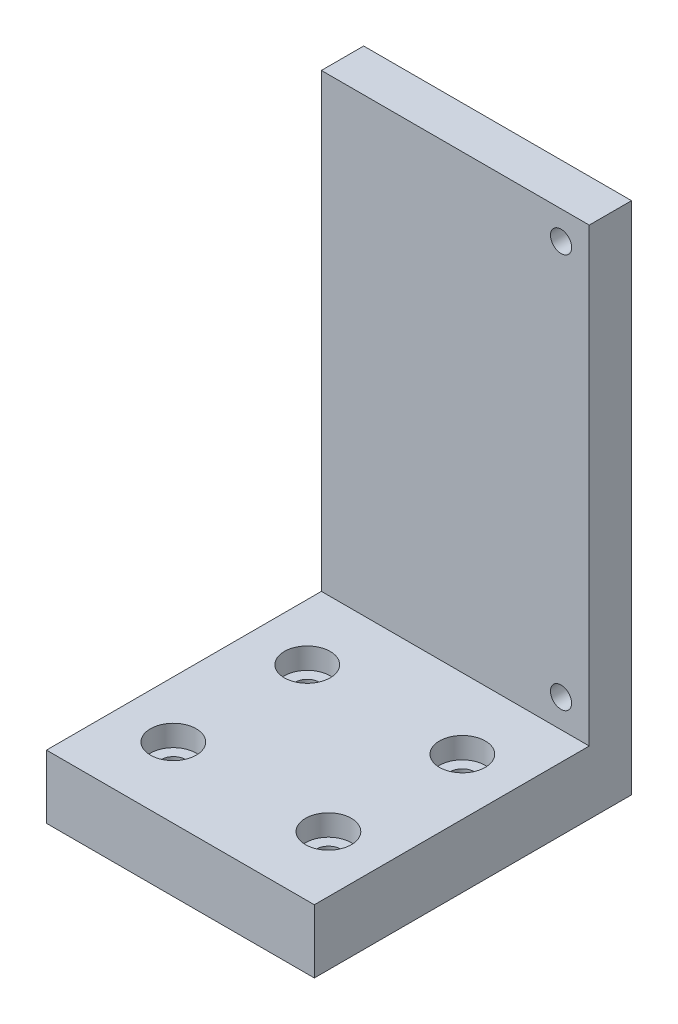
ISO-10303-21;
HEADER;
FILE_DESCRIPTION(('STEP AP214'),'2;1');
FILE_NAME('part.step','',(''),(''),'','','');
FILE_SCHEMA(('AUTOMOTIVE_DESIGN { 1 0 10303 214 1 1 1 1 }'));
ENDSEC;
DATA;
#1=APPLICATION_CONTEXT('core data for automotive mechanical design processes');
#2=APPLICATION_PROTOCOL_DEFINITION('international standard','automotive_design',2000,#1);
#3=PRODUCT_CONTEXT('',#1,'mechanical');
#4=PRODUCT('Part','Part','',(#3));
#5=PRODUCT_RELATED_PRODUCT_CATEGORY('part','',(#4));
#6=PRODUCT_DEFINITION_FORMATION('','',#4);
#7=PRODUCT_DEFINITION_CONTEXT('part definition',#1,'design');
#8=PRODUCT_DEFINITION('design','',#6,#7);
#9=PRODUCT_DEFINITION_SHAPE('','',#8);
#10=(LENGTH_UNIT() NAMED_UNIT(*) SI_UNIT(.MILLI.,.METRE.));
#11=(NAMED_UNIT(*) PLANE_ANGLE_UNIT() SI_UNIT($,.RADIAN.));
#12=(NAMED_UNIT(*) SI_UNIT($,.STERADIAN.) SOLID_ANGLE_UNIT());
#13=UNCERTAINTY_MEASURE_WITH_UNIT(LENGTH_MEASURE(1.E-05),#10,'distance_accuracy_value','');
#14=(GEOMETRIC_REPRESENTATION_CONTEXT(3) GLOBAL_UNCERTAINTY_ASSIGNED_CONTEXT((#13)) GLOBAL_UNIT_ASSIGNED_CONTEXT((#10,
#11,#12)) REPRESENTATION_CONTEXT('',''));
#15=CARTESIAN_POINT('',(0.,0.,0.));
#16=DIRECTION('',(0.,0.,1.));
#17=DIRECTION('',(1.,0.,0.));
#18=AXIS2_PLACEMENT_3D('',#15,#16,#17);
#19=CARTESIAN_POINT('',(0.,9.,0.));
#20=DIRECTION('',(0.,-1.,0.));
#21=DIRECTION('',(0.,0.,-1.));
#22=AXIS2_PLACEMENT_3D('',#19,#20,#21);
#23=PLANE('',#22);
#24=CARTESIAN_POINT('',(8.,9.,-29.));
#25=DIRECTION('',(0.,1.,0.));
#26=DIRECTION('',(0.,0.,1.));
#27=AXIS2_PLACEMENT_3D('',#24,#25,#26);
#28=CIRCLE('',#27,3.25);
#29=CARTESIAN_POINT('',(8.,9.,-25.75));
#30=VERTEX_POINT('',#29);
#31=EDGE_CURVE('E183',#30,#30,#28,.T.);
#32=ORIENTED_EDGE('',*,*,#31,.F.);
#33=EDGE_LOOP('',(#32));
#34=FACE_BOUND('',#33,.T.);
#35=CARTESIAN_POINT('',(8.,9.,-10.));
#36=DIRECTION('',(0.,1.,0.));
#37=DIRECTION('',(0.,0.,1.));
#38=AXIS2_PLACEMENT_3D('',#35,#36,#37);
#39=CIRCLE('',#38,3.25);
#40=CARTESIAN_POINT('',(8.,9.,-6.75));
#41=VERTEX_POINT('',#40);
#42=EDGE_CURVE('E171',#41,#41,#39,.T.);
#43=ORIENTED_EDGE('',*,*,#42,.F.);
#44=EDGE_LOOP('',(#43));
#45=FACE_BOUND('',#44,.T.);
#46=CARTESIAN_POINT('',(30.,9.,-10.));
#47=DIRECTION('',(0.,1.,0.));
#48=DIRECTION('',(0.,0.,1.));
#49=AXIS2_PLACEMENT_3D('',#46,#47,#48);
#50=CIRCLE('',#49,3.25);
#51=CARTESIAN_POINT('',(30.,9.,-6.75));
#52=VERTEX_POINT('',#51);
#53=EDGE_CURVE('E159',#52,#52,#50,.T.);
#54=ORIENTED_EDGE('',*,*,#53,.F.);
#55=EDGE_LOOP('',(#54));
#56=FACE_BOUND('',#55,.T.);
#57=CARTESIAN_POINT('',(30.,9.,-29.));
#58=DIRECTION('',(0.,1.,0.));
#59=DIRECTION('',(0.,0.,1.));
#60=AXIS2_PLACEMENT_3D('',#57,#58,#59);
#61=CIRCLE('',#60,3.25);
#62=CARTESIAN_POINT('',(30.,9.,-25.75));
#63=VERTEX_POINT('',#62);
#64=EDGE_CURVE('E147',#63,#63,#61,.T.);
#65=ORIENTED_EDGE('',*,*,#64,.F.);
#66=EDGE_LOOP('',(#65));
#67=FACE_BOUND('',#66,.T.);
#68=DIRECTION('',(1.,0.,0.));
#69=VECTOR('',#68,1.);
#70=CARTESIAN_POINT('',(0.,9.,-39.));
#71=LINE('',#70,#69);
#72=CARTESIAN_POINT('',(0.,9.,-39.));
#73=VERTEX_POINT('',#72);
#74=CARTESIAN_POINT('',(38.,9.,-39.));
#75=VERTEX_POINT('',#74);
#76=EDGE_CURVE('E49',#73,#75,#71,.T.);
#77=ORIENTED_EDGE('',*,*,#76,.F.);
#78=DIRECTION('',(0.,0.,-1.));
#79=VECTOR('',#78,1.);
#80=CARTESIAN_POINT('',(0.,9.,0.));
#81=LINE('',#80,#79);
#82=CARTESIAN_POINT('',(0.,9.,0.));
#83=VERTEX_POINT('',#82);
#84=EDGE_CURVE('E86',#83,#73,#81,.T.);
#85=ORIENTED_EDGE('',*,*,#84,.F.);
#86=DIRECTION('',(1.,0.,0.));
#87=VECTOR('',#86,1.);
#88=CARTESIAN_POINT('',(0.,9.,0.));
#89=LINE('',#88,#87);
#90=CARTESIAN_POINT('',(38.,9.,0.));
#91=VERTEX_POINT('',#90);
#92=EDGE_CURVE('E77',#83,#91,#89,.T.);
#93=ORIENTED_EDGE('',*,*,#92,.T.);
#94=DIRECTION('',(0.,0.,-1.));
#95=VECTOR('',#94,1.);
#96=CARTESIAN_POINT('',(38.,9.,0.));
#97=LINE('',#96,#95);
#98=EDGE_CURVE('E106',#91,#75,#97,.T.);
#99=ORIENTED_EDGE('',*,*,#98,.T.);
#100=EDGE_LOOP('',(#77,#85,#93,#99));
#101=FACE_BOUND('',#100,.T.);
#102=ADVANCED_FACE('F32',(#34,#45,#56,#67,#101),#23,.F.);
#103=CARTESIAN_POINT('',(0.,9.,0.));
#104=DIRECTION('',(-1.,0.,0.));
#105=DIRECTION('',(0.,0.,1.));
#106=AXIS2_PLACEMENT_3D('',#103,#104,#105);
#107=PLANE('',#106);
#108=DIRECTION('',(0.,0.,-1.));
#109=VECTOR('',#108,1.);
#110=CARTESIAN_POINT('',(0.,0.,0.));
#111=LINE('',#110,#109);
#112=CARTESIAN_POINT('',(0.,0.,0.));
#113=VERTEX_POINT('',#112);
#114=CARTESIAN_POINT('',(0.,0.,-45.));
#115=VERTEX_POINT('',#114);
#116=EDGE_CURVE('E83',#113,#115,#111,.T.);
#117=ORIENTED_EDGE('',*,*,#116,.F.);
#118=DIRECTION('',(0.,-1.,0.));
#119=VECTOR('',#118,1.);
#120=CARTESIAN_POINT('',(0.,9.,0.));
#121=LINE('',#120,#119);
#122=EDGE_CURVE('E11',#83,#113,#121,.T.);
#123=ORIENTED_EDGE('',*,*,#122,.F.);
#124=ORIENTED_EDGE('',*,*,#84,.T.);
#125=DIRECTION('',(0.,-1.,0.));
#126=VECTOR('',#125,1.);
#127=CARTESIAN_POINT('',(0.,73.,-39.));
#128=LINE('',#127,#126);
#129=CARTESIAN_POINT('',(0.,73.,-39.));
#130=VERTEX_POINT('',#129);
#131=EDGE_CURVE('E92',#130,#73,#128,.T.);
#132=ORIENTED_EDGE('',*,*,#131,.F.);
#133=DIRECTION('',(0.,0.,1.));
#134=VECTOR('',#133,1.);
#135=CARTESIAN_POINT('',(0.,73.,-45.));
#136=LINE('',#135,#134);
#137=CARTESIAN_POINT('',(0.,73.,-45.));
#138=VERTEX_POINT('',#137);
#139=EDGE_CURVE('E115',#138,#130,#136,.T.);
#140=ORIENTED_EDGE('',*,*,#139,.F.);
#141=DIRECTION('',(0.,-1.,0.));
#142=VECTOR('',#141,1.);
#143=CARTESIAN_POINT('',(0.,9.,-45.));
#144=LINE('',#143,#142);
#145=EDGE_CURVE('E36',#138,#115,#144,.T.);
#146=ORIENTED_EDGE('',*,*,#145,.T.);
#147=EDGE_LOOP('',(#117,#123,#124,#132,#140,#146));
#148=FACE_BOUND('',#147,.T.);
#149=ADVANCED_FACE('F34',(#148),#107,.T.);
#150=CARTESIAN_POINT('',(0.,9.,0.));
#151=DIRECTION('',(0.,0.,-1.));
#152=DIRECTION('',(-1.,0.,0.));
#153=AXIS2_PLACEMENT_3D('',#150,#151,#152);
#154=PLANE('',#153);
#155=DIRECTION('',(1.,0.,0.));
#156=VECTOR('',#155,1.);
#157=CARTESIAN_POINT('',(0.,0.,0.));
#158=LINE('',#157,#156);
#159=CARTESIAN_POINT('',(38.,0.,0.));
#160=VERTEX_POINT('',#159);
#161=EDGE_CURVE('E75',#113,#160,#158,.T.);
#162=ORIENTED_EDGE('',*,*,#161,.T.);
#163=DIRECTION('',(0.,-1.,0.));
#164=VECTOR('',#163,1.);
#165=CARTESIAN_POINT('',(38.,9.,0.));
#166=LINE('',#165,#164);
#167=EDGE_CURVE('E41',#91,#160,#166,.T.);
#168=ORIENTED_EDGE('',*,*,#167,.F.);
#169=ORIENTED_EDGE('',*,*,#92,.F.);
#170=ORIENTED_EDGE('',*,*,#122,.T.);
#171=EDGE_LOOP('',(#162,#168,#169,#170));
#172=FACE_BOUND('',#171,.T.);
#173=ADVANCED_FACE('F73',(#172),#154,.F.);
#174=CARTESIAN_POINT('',(38.,9.,0.));
#175=DIRECTION('',(-1.,0.,0.));
#176=DIRECTION('',(0.,0.,1.));
#177=AXIS2_PLACEMENT_3D('',#174,#175,#176);
#178=PLANE('',#177);
#179=DIRECTION('',(0.,0.,-1.));
#180=VECTOR('',#179,1.);
#181=CARTESIAN_POINT('',(38.,0.,0.));
#182=LINE('',#181,#180);
#183=CARTESIAN_POINT('',(38.,0.,-45.));
#184=VERTEX_POINT('',#183);
#185=EDGE_CURVE('E85',#160,#184,#182,.T.);
#186=ORIENTED_EDGE('',*,*,#185,.T.);
#187=DIRECTION('',(0.,-1.,0.));
#188=VECTOR('',#187,1.);
#189=CARTESIAN_POINT('',(38.,9.,-45.));
#190=LINE('',#189,#188);
#191=CARTESIAN_POINT('',(38.,73.,-45.));
#192=VERTEX_POINT('',#191);
#193=EDGE_CURVE('E102',#192,#184,#190,.T.);
#194=ORIENTED_EDGE('',*,*,#193,.F.);
#195=DIRECTION('',(0.,0.,-1.));
#196=VECTOR('',#195,1.);
#197=CARTESIAN_POINT('',(38.,73.,-45.));
#198=LINE('',#197,#196);
#199=CARTESIAN_POINT('',(38.,73.,-39.));
#200=VERTEX_POINT('',#199);
#201=EDGE_CURVE('E119',#200,#192,#198,.T.);
#202=ORIENTED_EDGE('',*,*,#201,.F.);
#203=DIRECTION('',(0.,-1.,0.));
#204=VECTOR('',#203,1.);
#205=CARTESIAN_POINT('',(38.,73.,-39.));
#206=LINE('',#205,#204);
#207=EDGE_CURVE('E96',#200,#75,#206,.T.);
#208=ORIENTED_EDGE('',*,*,#207,.T.);
#209=ORIENTED_EDGE('',*,*,#98,.F.);
#210=ORIENTED_EDGE('',*,*,#167,.T.);
#211=EDGE_LOOP('',(#186,#194,#202,#208,#209,#210));
#212=FACE_BOUND('',#211,.T.);
#213=ADVANCED_FACE('F242',(#212),#178,.F.);
#214=CARTESIAN_POINT('',(0.,9.,-45.));
#215=DIRECTION('',(0.,0.,-1.));
#216=DIRECTION('',(-1.,0.,0.));
#217=AXIS2_PLACEMENT_3D('',#214,#215,#216);
#218=PLANE('',#217);
#219=CARTESIAN_POINT('',(34.,69.,-45.));
#220=DIRECTION('',(0.,0.,-1.));
#221=DIRECTION('',(-1.,0.,0.));
#222=AXIS2_PLACEMENT_3D('',#219,#220,#221);
#223=CIRCLE('',#222,1.5);
#224=CARTESIAN_POINT('',(32.5,69.,-45.));
#225=VERTEX_POINT('',#224);
#226=EDGE_CURVE('E116',#225,#225,#223,.T.);
#227=ORIENTED_EDGE('',*,*,#226,.F.);
#228=EDGE_LOOP('',(#227));
#229=FACE_BOUND('',#228,.T.);
#230=CARTESIAN_POINT('',(34.,13.,-45.));
#231=DIRECTION('',(0.,0.,-1.));
#232=DIRECTION('',(-1.,0.,0.));
#233=AXIS2_PLACEMENT_3D('',#230,#231,#232);
#234=CIRCLE('',#233,1.5);
#235=CARTESIAN_POINT('',(32.5,13.,-45.));
#236=VERTEX_POINT('',#235);
#237=EDGE_CURVE('E129',#236,#236,#234,.T.);
#238=ORIENTED_EDGE('',*,*,#237,.F.);
#239=EDGE_LOOP('',(#238));
#240=FACE_BOUND('',#239,.T.);
#241=DIRECTION('',(1.,0.,0.));
#242=VECTOR('',#241,1.);
#243=CARTESIAN_POINT('',(0.,0.,-45.));
#244=LINE('',#243,#242);
#245=EDGE_CURVE('E91',#115,#184,#244,.T.);
#246=ORIENTED_EDGE('',*,*,#245,.F.);
#247=ORIENTED_EDGE('',*,*,#145,.F.);
#248=DIRECTION('',(-1.,0.,0.));
#249=VECTOR('',#248,1.);
#250=CARTESIAN_POINT('',(0.,73.,-45.));
#251=LINE('',#250,#249);
#252=EDGE_CURVE('E113',#192,#138,#251,.T.);
#253=ORIENTED_EDGE('',*,*,#252,.F.);
#254=ORIENTED_EDGE('',*,*,#193,.T.);
#255=EDGE_LOOP('',(#246,#247,#253,#254));
#256=FACE_BOUND('',#255,.T.);
#257=ADVANCED_FACE('F238',(#229,#240,#256),#218,.T.);
#258=CARTESIAN_POINT('',(0.,0.,0.));
#259=DIRECTION('',(0.,-1.,0.));
#260=DIRECTION('',(0.,0.,-1.));
#261=AXIS2_PLACEMENT_3D('',#258,#259,#260);
#262=PLANE('',#261);
#263=CARTESIAN_POINT('',(8.,0.,-29.));
#264=DIRECTION('',(0.,1.,0.));
#265=DIRECTION('',(0.,0.,1.));
#266=AXIS2_PLACEMENT_3D('',#263,#264,#265);
#267=CIRCLE('',#266,1.7);
#268=CARTESIAN_POINT('',(8.,0.,-27.3));
#269=VERTEX_POINT('',#268);
#270=EDGE_CURVE('E174',#269,#269,#267,.T.);
#271=ORIENTED_EDGE('',*,*,#270,.T.);
#272=EDGE_LOOP('',(#271));
#273=FACE_BOUND('',#272,.T.);
#274=CARTESIAN_POINT('',(8.,0.,-10.));
#275=DIRECTION('',(0.,1.,0.));
#276=DIRECTION('',(0.,0.,1.));
#277=AXIS2_PLACEMENT_3D('',#274,#275,#276);
#278=CIRCLE('',#277,1.7);
#279=CARTESIAN_POINT('',(8.,0.,-8.3));
#280=VERTEX_POINT('',#279);
#281=EDGE_CURVE('E162',#280,#280,#278,.T.);
#282=ORIENTED_EDGE('',*,*,#281,.T.);
#283=EDGE_LOOP('',(#282));
#284=FACE_BOUND('',#283,.T.);
#285=CARTESIAN_POINT('',(30.,0.,-10.));
#286=DIRECTION('',(0.,1.,0.));
#287=DIRECTION('',(0.,0.,1.));
#288=AXIS2_PLACEMENT_3D('',#285,#286,#287);
#289=CIRCLE('',#288,1.7);
#290=CARTESIAN_POINT('',(30.,0.,-8.3));
#291=VERTEX_POINT('',#290);
#292=EDGE_CURVE('E150',#291,#291,#289,.T.);
#293=ORIENTED_EDGE('',*,*,#292,.T.);
#294=EDGE_LOOP('',(#293));
#295=FACE_BOUND('',#294,.T.);
#296=CARTESIAN_POINT('',(30.,0.,-29.));
#297=DIRECTION('',(0.,1.,0.));
#298=DIRECTION('',(0.,0.,1.));
#299=AXIS2_PLACEMENT_3D('',#296,#297,#298);
#300=CIRCLE('',#299,1.7);
#301=CARTESIAN_POINT('',(30.,0.,-27.3));
#302=VERTEX_POINT('',#301);
#303=EDGE_CURVE('E136',#302,#302,#300,.T.);
#304=ORIENTED_EDGE('',*,*,#303,.T.);
#305=EDGE_LOOP('',(#304));
#306=FACE_BOUND('',#305,.T.);
#307=ORIENTED_EDGE('',*,*,#116,.T.);
#308=ORIENTED_EDGE('',*,*,#245,.T.);
#309=ORIENTED_EDGE('',*,*,#185,.F.);
#310=ORIENTED_EDGE('',*,*,#161,.F.);
#311=EDGE_LOOP('',(#307,#308,#309,#310));
#312=FACE_BOUND('',#311,.T.);
#313=ADVANCED_FACE('F81',(#273,#284,#295,#306,#312),#262,.T.);
#314=CARTESIAN_POINT('',(0.,73.,-39.));
#315=DIRECTION('',(0.,0.,-1.));
#316=DIRECTION('',(-1.,0.,0.));
#317=AXIS2_PLACEMENT_3D('',#314,#315,#316);
#318=PLANE('',#317);
#319=CARTESIAN_POINT('',(34.,69.,-39.));
#320=DIRECTION('',(0.,0.,1.));
#321=DIRECTION('',(1.,0.,0.));
#322=AXIS2_PLACEMENT_3D('',#319,#320,#321);
#323=CIRCLE('',#322,1.5);
#324=CARTESIAN_POINT('',(35.5,69.,-39.));
#325=VERTEX_POINT('',#324);
#326=EDGE_CURVE('E132',#325,#325,#323,.T.);
#327=ORIENTED_EDGE('',*,*,#326,.F.);
#328=EDGE_LOOP('',(#327));
#329=FACE_BOUND('',#328,.T.);
#330=CARTESIAN_POINT('',(34.,13.,-39.));
#331=DIRECTION('',(0.,0.,1.));
#332=DIRECTION('',(1.,0.,0.));
#333=AXIS2_PLACEMENT_3D('',#330,#331,#332);
#334=CIRCLE('',#333,1.5);
#335=CARTESIAN_POINT('',(35.5,13.,-39.));
#336=VERTEX_POINT('',#335);
#337=EDGE_CURVE('E133',#336,#336,#334,.T.);
#338=ORIENTED_EDGE('',*,*,#337,.F.);
#339=EDGE_LOOP('',(#338));
#340=FACE_BOUND('',#339,.T.);
#341=ORIENTED_EDGE('',*,*,#76,.T.);
#342=ORIENTED_EDGE('',*,*,#207,.F.);
#343=DIRECTION('',(1.,0.,0.));
#344=VECTOR('',#343,1.);
#345=CARTESIAN_POINT('',(0.,73.,-39.));
#346=LINE('',#345,#344);
#347=EDGE_CURVE('E122',#130,#200,#346,.T.);
#348=ORIENTED_EDGE('',*,*,#347,.F.);
#349=ORIENTED_EDGE('',*,*,#131,.T.);
#350=EDGE_LOOP('',(#341,#342,#348,#349));
#351=FACE_BOUND('',#350,.T.);
#352=ADVANCED_FACE('F231',(#329,#340,#351),#318,.F.);
#353=CARTESIAN_POINT('',(0.,73.,0.));
#354=DIRECTION('',(0.,1.,0.));
#355=DIRECTION('',(0.,0.,1.));
#356=AXIS2_PLACEMENT_3D('',#353,#354,#355);
#357=PLANE('',#356);
#358=ORIENTED_EDGE('',*,*,#139,.T.);
#359=ORIENTED_EDGE('',*,*,#347,.T.);
#360=ORIENTED_EDGE('',*,*,#201,.T.);
#361=ORIENTED_EDGE('',*,*,#252,.T.);
#362=EDGE_LOOP('',(#358,#359,#360,#361));
#363=FACE_BOUND('',#362,.T.);
#364=ADVANCED_FACE('F227',(#363),#357,.T.);
#365=CARTESIAN_POINT('',(34.,13.,-103.));
#366=DIRECTION('',(0.,0.,1.));
#367=DIRECTION('',(1.,0.,0.));
#368=AXIS2_PLACEMENT_3D('',#365,#366,#367);
#369=CYLINDRICAL_SURFACE('',#368,1.5);
#370=ORIENTED_EDGE('',*,*,#237,.T.);
#371=EDGE_LOOP('',(#370));
#372=FACE_BOUND('',#371,.T.);
#373=ORIENTED_EDGE('',*,*,#337,.T.);
#374=EDGE_LOOP('',(#373));
#375=FACE_BOUND('',#374,.T.);
#376=ADVANCED_FACE('F223',(#372,#375),#369,.F.);
#377=CARTESIAN_POINT('',(34.,69.,-103.));
#378=DIRECTION('',(0.,0.,1.));
#379=DIRECTION('',(1.,0.,0.));
#380=AXIS2_PLACEMENT_3D('',#377,#378,#379);
#381=CYLINDRICAL_SURFACE('',#380,1.5);
#382=ORIENTED_EDGE('',*,*,#226,.T.);
#383=EDGE_LOOP('',(#382));
#384=FACE_BOUND('',#383,.T.);
#385=ORIENTED_EDGE('',*,*,#326,.T.);
#386=EDGE_LOOP('',(#385));
#387=FACE_BOUND('',#386,.T.);
#388=ADVANCED_FACE('F219',(#384,#387),#381,.F.);
#389=CARTESIAN_POINT('',(30.,9.,-29.));
#390=DIRECTION('',(0.,1.,0.));
#391=DIRECTION('',(0.,0.,1.));
#392=AXIS2_PLACEMENT_3D('',#389,#390,#391);
#393=CYLINDRICAL_SURFACE('',#392,1.7);
#394=ORIENTED_EDGE('',*,*,#303,.F.);
#395=EDGE_LOOP('',(#394));
#396=FACE_BOUND('',#395,.T.);
#397=CARTESIAN_POINT('',(30.,6.,-29.));
#398=DIRECTION('',(0.,1.,0.));
#399=DIRECTION('',(0.,0.,1.));
#400=AXIS2_PLACEMENT_3D('',#397,#398,#399);
#401=CIRCLE('',#400,1.7);
#402=CARTESIAN_POINT('',(30.,6.,-27.3));
#403=VERTEX_POINT('',#402);
#404=EDGE_CURVE('E141',#403,#403,#401,.T.);
#405=ORIENTED_EDGE('',*,*,#404,.T.);
#406=EDGE_LOOP('',(#405));
#407=FACE_BOUND('',#406,.T.);
#408=ADVANCED_FACE('F211',(#396,#407),#393,.F.);
#409=CARTESIAN_POINT('',(31.7,6.,-29.));
#410=DIRECTION('',(0.,-1.,0.));
#411=DIRECTION('',(0.,0.,-1.));
#412=AXIS2_PLACEMENT_3D('',#409,#410,#411);
#413=PLANE('',#412);
#414=ORIENTED_EDGE('',*,*,#404,.F.);
#415=EDGE_LOOP('',(#414));
#416=FACE_BOUND('',#415,.T.);
#417=CARTESIAN_POINT('',(30.,6.,-29.));
#418=DIRECTION('',(0.,1.,0.));
#419=DIRECTION('',(0.,0.,1.));
#420=AXIS2_PLACEMENT_3D('',#417,#418,#419);
#421=CIRCLE('',#420,3.25);
#422=CARTESIAN_POINT('',(30.,6.,-25.75));
#423=VERTEX_POINT('',#422);
#424=EDGE_CURVE('E144',#423,#423,#421,.T.);
#425=ORIENTED_EDGE('',*,*,#424,.T.);
#426=EDGE_LOOP('',(#425));
#427=FACE_BOUND('',#426,.T.);
#428=ADVANCED_FACE('F201',(#416,#427),#413,.F.);
#429=CARTESIAN_POINT('',(30.,9.,-29.));
#430=DIRECTION('',(0.,1.,0.));
#431=DIRECTION('',(0.,0.,1.));
#432=AXIS2_PLACEMENT_3D('',#429,#430,#431);
#433=CYLINDRICAL_SURFACE('',#432,3.25);
#434=ORIENTED_EDGE('',*,*,#424,.F.);
#435=EDGE_LOOP('',(#434));
#436=FACE_BOUND('',#435,.T.);
#437=ORIENTED_EDGE('',*,*,#64,.T.);
#438=EDGE_LOOP('',(#437));
#439=FACE_BOUND('',#438,.T.);
#440=ADVANCED_FACE('F198',(#436,#439),#433,.F.);
#441=CARTESIAN_POINT('',(30.,9.,-10.));
#442=DIRECTION('',(0.,1.,0.));
#443=DIRECTION('',(0.,0.,1.));
#444=AXIS2_PLACEMENT_3D('',#441,#442,#443);
#445=CYLINDRICAL_SURFACE('',#444,1.7);
#446=ORIENTED_EDGE('',*,*,#292,.F.);
#447=EDGE_LOOP('',(#446));
#448=FACE_BOUND('',#447,.T.);
#449=CARTESIAN_POINT('',(30.,6.,-10.));
#450=DIRECTION('',(0.,1.,0.));
#451=DIRECTION('',(0.,0.,1.));
#452=AXIS2_PLACEMENT_3D('',#449,#450,#451);
#453=CIRCLE('',#452,1.7);
#454=CARTESIAN_POINT('',(30.,6.,-8.3));
#455=VERTEX_POINT('',#454);
#456=EDGE_CURVE('E153',#455,#455,#453,.T.);
#457=ORIENTED_EDGE('',*,*,#456,.T.);
#458=EDGE_LOOP('',(#457));
#459=FACE_BOUND('',#458,.T.);
#460=ADVANCED_FACE('F200',(#448,#459),#445,.F.);
#461=CARTESIAN_POINT('',(31.7,6.,-10.));
#462=DIRECTION('',(0.,-1.,0.));
#463=DIRECTION('',(0.,0.,-1.));
#464=AXIS2_PLACEMENT_3D('',#461,#462,#463);
#465=PLANE('',#464);
#466=ORIENTED_EDGE('',*,*,#456,.F.);
#467=EDGE_LOOP('',(#466));
#468=FACE_BOUND('',#467,.T.);
#469=CARTESIAN_POINT('',(30.,6.,-10.));
#470=DIRECTION('',(0.,1.,0.));
#471=DIRECTION('',(0.,0.,1.));
#472=AXIS2_PLACEMENT_3D('',#469,#470,#471);
#473=CIRCLE('',#472,3.25);
#474=CARTESIAN_POINT('',(30.,6.,-6.75));
#475=VERTEX_POINT('',#474);
#476=EDGE_CURVE('E156',#475,#475,#473,.T.);
#477=ORIENTED_EDGE('',*,*,#476,.T.);
#478=EDGE_LOOP('',(#477));
#479=FACE_BOUND('',#478,.T.);
#480=ADVANCED_FACE('F208',(#468,#479),#465,.F.);
#481=CARTESIAN_POINT('',(30.,9.,-10.));
#482=DIRECTION('',(0.,1.,0.));
#483=DIRECTION('',(0.,0.,1.));
#484=AXIS2_PLACEMENT_3D('',#481,#482,#483);
#485=CYLINDRICAL_SURFACE('',#484,3.25);
#486=ORIENTED_EDGE('',*,*,#476,.F.);
#487=EDGE_LOOP('',(#486));
#488=FACE_BOUND('',#487,.T.);
#489=ORIENTED_EDGE('',*,*,#53,.T.);
#490=EDGE_LOOP('',(#489));
#491=FACE_BOUND('',#490,.T.);
#492=ADVANCED_FACE('F319',(#488,#491),#485,.F.);
#493=CARTESIAN_POINT('',(8.,9.,-10.));
#494=DIRECTION('',(0.,1.,0.));
#495=DIRECTION('',(0.,0.,1.));
#496=AXIS2_PLACEMENT_3D('',#493,#494,#495);
#497=CYLINDRICAL_SURFACE('',#496,1.7);
#498=ORIENTED_EDGE('',*,*,#281,.F.);
#499=EDGE_LOOP('',(#498));
#500=FACE_BOUND('',#499,.T.);
#501=CARTESIAN_POINT('',(8.,6.,-10.));
#502=DIRECTION('',(0.,1.,0.));
#503=DIRECTION('',(0.,0.,1.));
#504=AXIS2_PLACEMENT_3D('',#501,#502,#503);
#505=CIRCLE('',#504,1.7);
#506=CARTESIAN_POINT('',(8.,6.,-8.3));
#507=VERTEX_POINT('',#506);
#508=EDGE_CURVE('E165',#507,#507,#505,.T.);
#509=ORIENTED_EDGE('',*,*,#508,.T.);
#510=EDGE_LOOP('',(#509));
#511=FACE_BOUND('',#510,.T.);
#512=ADVANCED_FACE('F328',(#500,#511),#497,.F.);
#513=CARTESIAN_POINT('',(9.7,6.,-10.));
#514=DIRECTION('',(0.,-1.,0.));
#515=DIRECTION('',(0.,0.,-1.));
#516=AXIS2_PLACEMENT_3D('',#513,#514,#515);
#517=PLANE('',#516);
#518=ORIENTED_EDGE('',*,*,#508,.F.);
#519=EDGE_LOOP('',(#518));
#520=FACE_BOUND('',#519,.T.);
#521=CARTESIAN_POINT('',(8.,6.,-10.));
#522=DIRECTION('',(0.,1.,0.));
#523=DIRECTION('',(0.,0.,1.));
#524=AXIS2_PLACEMENT_3D('',#521,#522,#523);
#525=CIRCLE('',#524,3.25);
#526=CARTESIAN_POINT('',(8.,6.,-6.75));
#527=VERTEX_POINT('',#526);
#528=EDGE_CURVE('E168',#527,#527,#525,.T.);
#529=ORIENTED_EDGE('',*,*,#528,.T.);
#530=EDGE_LOOP('',(#529));
#531=FACE_BOUND('',#530,.T.);
#532=ADVANCED_FACE('F338',(#520,#531),#517,.F.);
#533=CARTESIAN_POINT('',(8.,9.,-10.));
#534=DIRECTION('',(0.,1.,0.));
#535=DIRECTION('',(0.,0.,1.));
#536=AXIS2_PLACEMENT_3D('',#533,#534,#535);
#537=CYLINDRICAL_SURFACE('',#536,3.25);
#538=ORIENTED_EDGE('',*,*,#528,.F.);
#539=EDGE_LOOP('',(#538));
#540=FACE_BOUND('',#539,.T.);
#541=ORIENTED_EDGE('',*,*,#42,.T.);
#542=EDGE_LOOP('',(#541));
#543=FACE_BOUND('',#542,.T.);
#544=ADVANCED_FACE('F348',(#540,#543),#537,.F.);
#545=CARTESIAN_POINT('',(8.,9.,-29.));
#546=DIRECTION('',(0.,1.,0.));
#547=DIRECTION('',(0.,0.,1.));
#548=AXIS2_PLACEMENT_3D('',#545,#546,#547);
#549=CYLINDRICAL_SURFACE('',#548,1.7);
#550=ORIENTED_EDGE('',*,*,#270,.F.);
#551=EDGE_LOOP('',(#550));
#552=FACE_BOUND('',#551,.T.);
#553=CARTESIAN_POINT('',(8.,6.,-29.));
#554=DIRECTION('',(0.,1.,0.));
#555=DIRECTION('',(0.,0.,1.));
#556=AXIS2_PLACEMENT_3D('',#553,#554,#555);
#557=CIRCLE('',#556,1.7);
#558=CARTESIAN_POINT('',(8.,6.,-27.3));
#559=VERTEX_POINT('',#558);
#560=EDGE_CURVE('E177',#559,#559,#557,.T.);
#561=ORIENTED_EDGE('',*,*,#560,.T.);
#562=EDGE_LOOP('',(#561));
#563=FACE_BOUND('',#562,.T.);
#564=ADVANCED_FACE('F358',(#552,#563),#549,.F.);
#565=CARTESIAN_POINT('',(9.7,6.,-29.));
#566=DIRECTION('',(0.,-1.,0.));
#567=DIRECTION('',(0.,0.,-1.));
#568=AXIS2_PLACEMENT_3D('',#565,#566,#567);
#569=PLANE('',#568);
#570=ORIENTED_EDGE('',*,*,#560,.F.);
#571=EDGE_LOOP('',(#570));
#572=FACE_BOUND('',#571,.T.);
#573=CARTESIAN_POINT('',(8.,6.,-29.));
#574=DIRECTION('',(0.,1.,0.));
#575=DIRECTION('',(0.,0.,1.));
#576=AXIS2_PLACEMENT_3D('',#573,#574,#575);
#577=CIRCLE('',#576,3.25);
#578=CARTESIAN_POINT('',(8.,6.,-25.75));
#579=VERTEX_POINT('',#578);
#580=EDGE_CURVE('E180',#579,#579,#577,.T.);
#581=ORIENTED_EDGE('',*,*,#580,.T.);
#582=EDGE_LOOP('',(#581));
#583=FACE_BOUND('',#582,.T.);
#584=ADVANCED_FACE('F368',(#572,#583),#569,.F.);
#585=CARTESIAN_POINT('',(8.,9.,-29.));
#586=DIRECTION('',(0.,1.,0.));
#587=DIRECTION('',(0.,0.,1.));
#588=AXIS2_PLACEMENT_3D('',#585,#586,#587);
#589=CYLINDRICAL_SURFACE('',#588,3.25);
#590=ORIENTED_EDGE('',*,*,#580,.F.);
#591=EDGE_LOOP('',(#590));
#592=FACE_BOUND('',#591,.T.);
#593=ORIENTED_EDGE('',*,*,#31,.T.);
#594=EDGE_LOOP('',(#593));
#595=FACE_BOUND('',#594,.T.);
#596=ADVANCED_FACE('F187',(#592,#595),#589,.F.);
#597=CLOSED_SHELL('',(#102,#149,#173,#213,#257,#313,#352,#364,#376,#388,#408,#428,#440,#460,
#480,#492,#512,#532,#544,#564,#584,#596));
#598=MANIFOLD_SOLID_BREP('B2',#597);
#599=ADVANCED_BREP_SHAPE_REPRESENTATION('',(#18,#598),#14);
#600=SHAPE_DEFINITION_REPRESENTATION(#9,#599);
ENDSEC;
END-ISO-10303-21;
